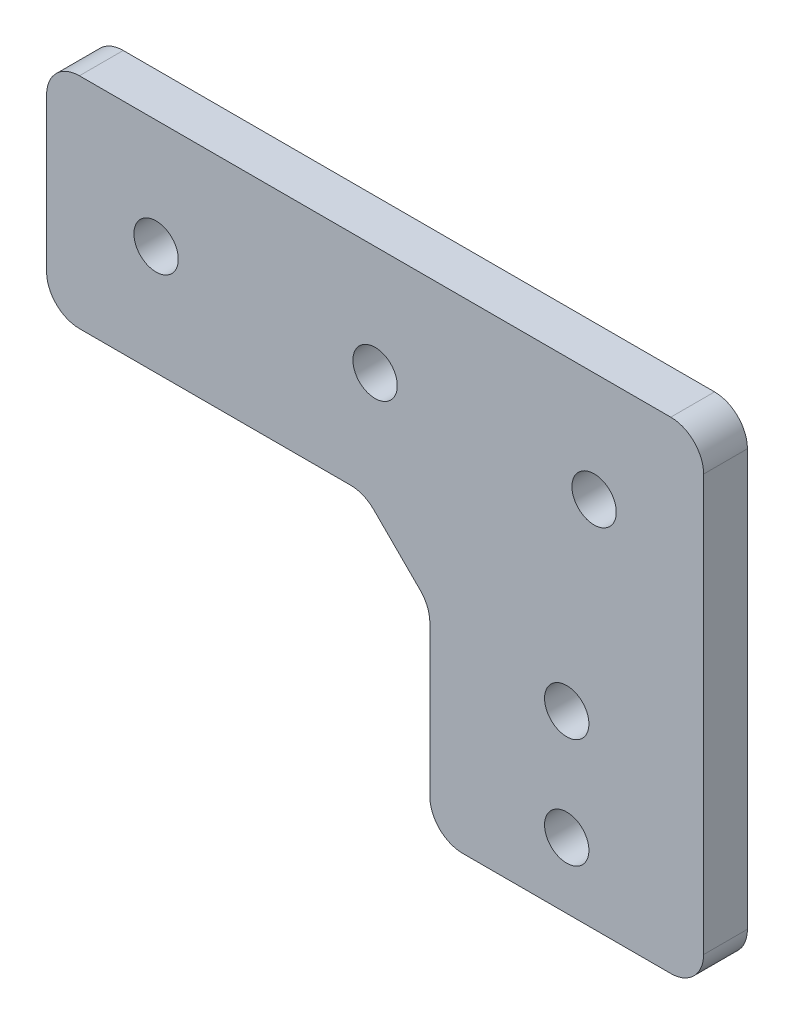
ISO-10303-21;
HEADER;
FILE_DESCRIPTION(('STEP AP214'),'2;1');
FILE_NAME('part.step','',(''),(''),'','','');
FILE_SCHEMA(('AUTOMOTIVE_DESIGN { 1 0 10303 214 1 1 1 1 }'));
ENDSEC;
DATA;
#1=APPLICATION_CONTEXT('core data for automotive mechanical design processes');
#2=APPLICATION_PROTOCOL_DEFINITION('international standard','automotive_design',2000,#1);
#3=PRODUCT_CONTEXT('',#1,'mechanical');
#4=PRODUCT('Part','Part','',(#3));
#5=PRODUCT_RELATED_PRODUCT_CATEGORY('part','',(#4));
#6=PRODUCT_DEFINITION_FORMATION('','',#4);
#7=PRODUCT_DEFINITION_CONTEXT('part definition',#1,'design');
#8=PRODUCT_DEFINITION('design','',#6,#7);
#9=PRODUCT_DEFINITION_SHAPE('','',#8);
#10=(LENGTH_UNIT() NAMED_UNIT(*) SI_UNIT(.MILLI.,.METRE.));
#11=(NAMED_UNIT(*) PLANE_ANGLE_UNIT() SI_UNIT($,.RADIAN.));
#12=(NAMED_UNIT(*) SI_UNIT($,.STERADIAN.) SOLID_ANGLE_UNIT());
#13=UNCERTAINTY_MEASURE_WITH_UNIT(LENGTH_MEASURE(1.E-05),#10,'distance_accuracy_value','');
#14=(GEOMETRIC_REPRESENTATION_CONTEXT(3) GLOBAL_UNCERTAINTY_ASSIGNED_CONTEXT((#13)) GLOBAL_UNIT_ASSIGNED_CONTEXT((#10,
#11,#12)) REPRESENTATION_CONTEXT('',''));
#15=CARTESIAN_POINT('',(0.,0.,0.));
#16=DIRECTION('',(0.,0.,1.));
#17=DIRECTION('',(1.,0.,0.));
#18=AXIS2_PLACEMENT_3D('',#15,#16,#17);
#19=CARTESIAN_POINT('',(-35.,20.,4.));
#20=DIRECTION('',(1.,0.,0.));
#21=DIRECTION('',(0.,1.,0.));
#22=AXIS2_PLACEMENT_3D('',#19,#20,#21);
#23=PLANE('',#22);
#24=DIRECTION('',(0.,-1.,0.));
#25=VECTOR('',#24,1.);
#26=CARTESIAN_POINT('',(-35.,20.,0.));
#27=LINE('',#26,#25);
#28=CARTESIAN_POINT('',(-35.,17.,0.));
#29=VERTEX_POINT('',#28);
#30=CARTESIAN_POINT('',(-35.,3.00000000000001,0.));
#31=VERTEX_POINT('',#30);
#32=EDGE_CURVE('E242',#29,#31,#27,.T.);
#33=ORIENTED_EDGE('',*,*,#32,.T.);
#34=DIRECTION('',(0.,0.,-1.));
#35=VECTOR('',#34,1.);
#36=CARTESIAN_POINT('',(-35.,3.00000000000001,4.));
#37=LINE('',#36,#35);
#38=CARTESIAN_POINT('',(-35.,3.00000000000001,4.));
#39=VERTEX_POINT('',#38);
#40=EDGE_CURVE('E205',#31,#39,#37,.F.);
#41=ORIENTED_EDGE('',*,*,#40,.T.);
#42=DIRECTION('',(0.,-1.,0.));
#43=VECTOR('',#42,1.);
#44=CARTESIAN_POINT('',(-35.,20.,4.));
#45=LINE('',#44,#43);
#46=CARTESIAN_POINT('',(-35.,17.,4.));
#47=VERTEX_POINT('',#46);
#48=EDGE_CURVE('E236',#47,#39,#45,.T.);
#49=ORIENTED_EDGE('',*,*,#48,.F.);
#50=DIRECTION('',(0.,0.,-1.));
#51=VECTOR('',#50,1.);
#52=CARTESIAN_POINT('',(-35.,17.,4.));
#53=LINE('',#52,#51);
#54=EDGE_CURVE('E202',#47,#29,#53,.T.);
#55=ORIENTED_EDGE('',*,*,#54,.T.);
#56=EDGE_LOOP('',(#33,#41,#49,#55));
#57=FACE_BOUND('',#56,.T.);
#58=ADVANCED_FACE('F35',(#57),#23,.F.);
#59=CARTESIAN_POINT('',(-35.,0.,4.));
#60=DIRECTION('',(0.,1.,0.));
#61=DIRECTION('',(0.,0.,1.));
#62=AXIS2_PLACEMENT_3D('',#59,#60,#61);
#63=PLANE('',#62);
#64=DIRECTION('',(1.,0.,0.));
#65=VECTOR('',#64,1.);
#66=CARTESIAN_POINT('',(-35.,0.,0.));
#67=LINE('',#66,#65);
#68=CARTESIAN_POINT('',(-32.,0.,0.));
#69=VERTEX_POINT('',#68);
#70=CARTESIAN_POINT('',(-7.24264068711929,0.,0.));
#71=VERTEX_POINT('',#70);
#72=EDGE_CURVE('E245',#69,#71,#67,.T.);
#73=ORIENTED_EDGE('',*,*,#72,.T.);
#74=DIRECTION('',(0.,0.,-1.));
#75=VECTOR('',#74,1.);
#76=CARTESIAN_POINT('',(-7.24264068711929,0.,4.));
#77=LINE('',#76,#75);
#78=CARTESIAN_POINT('',(-7.24264068711929,0.,4.));
#79=VERTEX_POINT('',#78);
#80=EDGE_CURVE('E200',#71,#79,#77,.F.);
#81=ORIENTED_EDGE('',*,*,#80,.T.);
#82=DIRECTION('',(1.,0.,0.));
#83=VECTOR('',#82,1.);
#84=CARTESIAN_POINT('',(-35.,0.,4.));
#85=LINE('',#84,#83);
#86=CARTESIAN_POINT('',(-32.,0.,4.));
#87=VERTEX_POINT('',#86);
#88=EDGE_CURVE('E233',#87,#79,#85,.T.);
#89=ORIENTED_EDGE('',*,*,#88,.F.);
#90=DIRECTION('',(0.,0.,-1.));
#91=VECTOR('',#90,1.);
#92=CARTESIAN_POINT('',(-32.,0.,4.));
#93=LINE('',#92,#91);
#94=EDGE_CURVE('E197',#87,#69,#93,.T.);
#95=ORIENTED_EDGE('',*,*,#94,.T.);
#96=EDGE_LOOP('',(#73,#81,#89,#95));
#97=FACE_BOUND('',#96,.T.);
#98=ADVANCED_FACE('F272',(#97),#63,.F.);
#99=CARTESIAN_POINT('',(0.,0.,4.));
#100=DIRECTION('',(1.,0.,0.));
#101=DIRECTION('',(0.,1.,0.));
#102=AXIS2_PLACEMENT_3D('',#99,#100,#101);
#103=PLANE('',#102);
#104=DIRECTION('',(0.,-1.,0.));
#105=VECTOR('',#104,1.);
#106=CARTESIAN_POINT('',(0.,0.,0.));
#107=LINE('',#106,#105);
#108=CARTESIAN_POINT('',(0.,-7.24264068711929,0.));
#109=VERTEX_POINT('',#108);
#110=CARTESIAN_POINT('',(0.,-21.,0.));
#111=VERTEX_POINT('',#110);
#112=EDGE_CURVE('E221',#109,#111,#107,.T.);
#113=ORIENTED_EDGE('',*,*,#112,.T.);
#114=DIRECTION('',(0.,0.,-1.));
#115=VECTOR('',#114,1.);
#116=CARTESIAN_POINT('',(0.,-21.,4.));
#117=LINE('',#116,#115);
#118=CARTESIAN_POINT('',(0.,-21.,4.));
#119=VERTEX_POINT('',#118);
#120=EDGE_CURVE('E50',#111,#119,#117,.F.);
#121=ORIENTED_EDGE('',*,*,#120,.T.);
#122=DIRECTION('',(0.,-1.,0.));
#123=VECTOR('',#122,1.);
#124=CARTESIAN_POINT('',(0.,0.,4.));
#125=LINE('',#124,#123);
#126=CARTESIAN_POINT('',(0.,-7.24264068711929,4.));
#127=VERTEX_POINT('',#126);
#128=EDGE_CURVE('E159',#127,#119,#125,.T.);
#129=ORIENTED_EDGE('',*,*,#128,.F.);
#130=DIRECTION('',(0.,0.,-1.));
#131=VECTOR('',#130,1.);
#132=CARTESIAN_POINT('',(0.,-7.24264068711929,4.));
#133=LINE('',#132,#131);
#134=EDGE_CURVE('E147',#127,#109,#133,.T.);
#135=ORIENTED_EDGE('',*,*,#134,.T.);
#136=EDGE_LOOP('',(#113,#121,#129,#135));
#137=FACE_BOUND('',#136,.T.);
#138=ADVANCED_FACE('F231',(#137),#103,.F.);
#139=CARTESIAN_POINT('',(25.,-30.,4.));
#140=DIRECTION('',(-1.,0.,0.));
#141=DIRECTION('',(0.,-1.,0.));
#142=AXIS2_PLACEMENT_3D('',#139,#140,#141);
#143=PLANE('',#142);
#144=DIRECTION('',(0.,1.,0.));
#145=VECTOR('',#144,1.);
#146=CARTESIAN_POINT('',(25.,-30.,4.));
#147=LINE('',#146,#145);
#148=CARTESIAN_POINT('',(25.,-21.,4.));
#149=VERTEX_POINT('',#148);
#150=CARTESIAN_POINT('',(25.,17.,4.));
#151=VERTEX_POINT('',#150);
#152=EDGE_CURVE('E140',#149,#151,#147,.T.);
#153=ORIENTED_EDGE('',*,*,#152,.F.);
#154=DIRECTION('',(0.,0.,-1.));
#155=VECTOR('',#154,1.);
#156=CARTESIAN_POINT('',(25.,-21.,4.));
#157=LINE('',#156,#155);
#158=CARTESIAN_POINT('',(25.,-21.,0.));
#159=VERTEX_POINT('',#158);
#160=EDGE_CURVE('E154',#149,#159,#157,.T.);
#161=ORIENTED_EDGE('',*,*,#160,.T.);
#162=DIRECTION('',(0.,1.,0.));
#163=VECTOR('',#162,1.);
#164=CARTESIAN_POINT('',(25.,-30.,0.));
#165=LINE('',#164,#163);
#166=CARTESIAN_POINT('',(25.,17.,0.));
#167=VERTEX_POINT('',#166);
#168=EDGE_CURVE('E249',#159,#167,#165,.T.);
#169=ORIENTED_EDGE('',*,*,#168,.T.);
#170=DIRECTION('',(0.,0.,-1.));
#171=VECTOR('',#170,1.);
#172=CARTESIAN_POINT('',(25.,17.,4.));
#173=LINE('',#172,#171);
#174=EDGE_CURVE('E157',#167,#151,#173,.F.);
#175=ORIENTED_EDGE('',*,*,#174,.T.);
#176=EDGE_LOOP('',(#153,#161,#169,#175));
#177=FACE_BOUND('',#176,.T.);
#178=ADVANCED_FACE('F152',(#177),#143,.F.);
#179=CARTESIAN_POINT('',(25.,20.,4.));
#180=DIRECTION('',(0.,-1.,0.));
#181=DIRECTION('',(1.,0.,0.));
#182=AXIS2_PLACEMENT_3D('',#179,#180,#181);
#183=PLANE('',#182);
#184=DIRECTION('',(-1.,0.,0.));
#185=VECTOR('',#184,1.);
#186=CARTESIAN_POINT('',(25.,20.,0.));
#187=LINE('',#186,#185);
#188=CARTESIAN_POINT('',(22.,20.,0.));
#189=VERTEX_POINT('',#188);
#190=CARTESIAN_POINT('',(-32.,20.,0.));
#191=VERTEX_POINT('',#190);
#192=EDGE_CURVE('E251',#189,#191,#187,.T.);
#193=ORIENTED_EDGE('',*,*,#192,.T.);
#194=DIRECTION('',(0.,0.,-1.));
#195=VECTOR('',#194,1.);
#196=CARTESIAN_POINT('',(-32.,20.,4.));
#197=LINE('',#196,#195);
#198=CARTESIAN_POINT('',(-32.,20.,4.));
#199=VERTEX_POINT('',#198);
#200=EDGE_CURVE('E210',#191,#199,#197,.F.);
#201=ORIENTED_EDGE('',*,*,#200,.T.);
#202=DIRECTION('',(-1.,0.,0.));
#203=VECTOR('',#202,1.);
#204=CARTESIAN_POINT('',(25.,20.,4.));
#205=LINE('',#204,#203);
#206=CARTESIAN_POINT('',(22.,20.,4.));
#207=VERTEX_POINT('',#206);
#208=EDGE_CURVE('E158',#207,#199,#205,.T.);
#209=ORIENTED_EDGE('',*,*,#208,.F.);
#210=DIRECTION('',(0.,0.,-1.));
#211=VECTOR('',#210,1.);
#212=CARTESIAN_POINT('',(22.,20.,4.));
#213=LINE('',#212,#211);
#214=EDGE_CURVE('E207',#207,#189,#213,.T.);
#215=ORIENTED_EDGE('',*,*,#214,.T.);
#216=EDGE_LOOP('',(#193,#201,#209,#215));
#217=FACE_BOUND('',#216,.T.);
#218=ADVANCED_FACE('F285',(#217),#183,.F.);
#219=CARTESIAN_POINT('',(0.,0.,4.));
#220=DIRECTION('',(0.,0.,1.));
#221=DIRECTION('',(1.,0.,0.));
#222=AXIS2_PLACEMENT_3D('',#219,#220,#221);
#223=PLANE('',#222);
#224=DIRECTION('',(1.,0.,0.));
#225=VECTOR('',#224,1.);
#226=CARTESIAN_POINT('',(25.,-24.,4.));
#227=LINE('',#226,#225);
#228=CARTESIAN_POINT('',(3.00000000000001,-24.,4.));
#229=VERTEX_POINT('',#228);
#230=CARTESIAN_POINT('',(22.,-24.,4.));
#231=VERTEX_POINT('',#230);
#232=EDGE_CURVE('E143',#229,#231,#227,.T.);
#233=ORIENTED_EDGE('',*,*,#232,.T.);
#234=CARTESIAN_POINT('',(22.,-21.,4.));
#235=DIRECTION('',(0.,0.,1.));
#236=DIRECTION('',(1.,0.,0.));
#237=AXIS2_PLACEMENT_3D('',#234,#235,#236);
#238=CIRCLE('',#237,3.);
#239=EDGE_CURVE('E136',#231,#149,#238,.T.);
#240=ORIENTED_EDGE('',*,*,#239,.T.);
#241=ORIENTED_EDGE('',*,*,#152,.T.);
#242=CARTESIAN_POINT('',(22.,17.,4.));
#243=DIRECTION('',(0.,0.,1.));
#244=DIRECTION('',(1.,0.,0.));
#245=AXIS2_PLACEMENT_3D('',#242,#243,#244);
#246=CIRCLE('',#245,3.);
#247=EDGE_CURVE('E182',#151,#207,#246,.T.);
#248=ORIENTED_EDGE('',*,*,#247,.T.);
#249=ORIENTED_EDGE('',*,*,#208,.T.);
#250=CARTESIAN_POINT('',(-32.,17.,4.));
#251=DIRECTION('',(0.,0.,1.));
#252=DIRECTION('',(1.,0.,0.));
#253=AXIS2_PLACEMENT_3D('',#250,#251,#252);
#254=CIRCLE('',#253,3.);
#255=EDGE_CURVE('E184',#199,#47,#254,.T.);
#256=ORIENTED_EDGE('',*,*,#255,.T.);
#257=ORIENTED_EDGE('',*,*,#48,.T.);
#258=CARTESIAN_POINT('',(-32.,3.,4.));
#259=DIRECTION('',(0.,0.,1.));
#260=DIRECTION('',(1.,0.,0.));
#261=AXIS2_PLACEMENT_3D('',#258,#259,#260);
#262=CIRCLE('',#261,3.);
#263=EDGE_CURVE('E186',#39,#87,#262,.T.);
#264=ORIENTED_EDGE('',*,*,#263,.T.);
#265=ORIENTED_EDGE('',*,*,#88,.T.);
#266=CARTESIAN_POINT('',(-7.24264068711929,-3.,4.));
#267=DIRECTION('',(0.,0.,1.));
#268=DIRECTION('',(1.,0.,0.));
#269=AXIS2_PLACEMENT_3D('',#266,#267,#268);
#270=CIRCLE('',#269,3.);
#271=CARTESIAN_POINT('',(-5.12132034355964,-0.878679656440356,4.));
#272=VERTEX_POINT('',#271);
#273=EDGE_CURVE('E214',#79,#272,#270,.F.);
#274=ORIENTED_EDGE('',*,*,#273,.T.);
#275=DIRECTION('',(-0.707106781186547,0.707106781186548,0.));
#276=VECTOR('',#275,1.);
#277=CARTESIAN_POINT('',(0.,-6.,4.));
#278=LINE('',#277,#276);
#279=CARTESIAN_POINT('',(-0.878679656440354,-5.12132034355965,4.));
#280=VERTEX_POINT('',#279);
#281=EDGE_CURVE('E229',#280,#272,#278,.T.);
#282=ORIENTED_EDGE('',*,*,#281,.F.);
#283=CARTESIAN_POINT('',(-3.,-7.24264068711929,4.));
#284=DIRECTION('',(0.,0.,1.));
#285=DIRECTION('',(1.,0.,0.));
#286=AXIS2_PLACEMENT_3D('',#283,#284,#285);
#287=CIRCLE('',#286,3.);
#288=EDGE_CURVE('E11',#280,#127,#287,.F.);
#289=ORIENTED_EDGE('',*,*,#288,.T.);
#290=ORIENTED_EDGE('',*,*,#128,.T.);
#291=CARTESIAN_POINT('',(3.00000000000001,-21.,4.));
#292=DIRECTION('',(0.,0.,1.));
#293=DIRECTION('',(1.,0.,0.));
#294=AXIS2_PLACEMENT_3D('',#291,#292,#293);
#295=CIRCLE('',#294,3.);
#296=EDGE_CURVE('E148',#119,#229,#295,.T.);
#297=ORIENTED_EDGE('',*,*,#296,.T.);
#298=EDGE_LOOP('',(#233,#240,#241,#248,#249,#256,#257,#264,#265,#274,#282,#289,#290,#297));
#299=FACE_BOUND('',#298,.T.);
#300=CARTESIAN_POINT('',(15.,10.,4.));
#301=DIRECTION('',(0.,0.,-1.));
#302=DIRECTION('',(-1.,0.,0.));
#303=AXIS2_PLACEMENT_3D('',#300,#301,#302);
#304=CIRCLE('',#303,2.025);
#305=CARTESIAN_POINT('',(12.975,10.,4.));
#306=VERTEX_POINT('',#305);
#307=EDGE_CURVE('E393',#306,#306,#304,.T.);
#308=ORIENTED_EDGE('',*,*,#307,.T.);
#309=EDGE_LOOP('',(#308));
#310=FACE_BOUND('',#309,.T.);
#311=CARTESIAN_POINT('',(-5.,10.,4.));
#312=DIRECTION('',(0.,0.,-1.));
#313=DIRECTION('',(-1.,0.,0.));
#314=AXIS2_PLACEMENT_3D('',#311,#312,#313);
#315=CIRCLE('',#314,2.025);
#316=CARTESIAN_POINT('',(-7.025,10.,4.));
#317=VERTEX_POINT('',#316);
#318=EDGE_CURVE('E410',#317,#317,#315,.T.);
#319=ORIENTED_EDGE('',*,*,#318,.T.);
#320=EDGE_LOOP('',(#319));
#321=FACE_BOUND('',#320,.T.);
#322=CARTESIAN_POINT('',(-25.,10.,4.));
#323=DIRECTION('',(0.,0.,-1.));
#324=DIRECTION('',(-1.,0.,0.));
#325=AXIS2_PLACEMENT_3D('',#322,#323,#324);
#326=CIRCLE('',#325,2.025);
#327=CARTESIAN_POINT('',(-27.025,10.,4.));
#328=VERTEX_POINT('',#327);
#329=EDGE_CURVE('E404',#328,#328,#326,.T.);
#330=ORIENTED_EDGE('',*,*,#329,.T.);
#331=EDGE_LOOP('',(#330));
#332=FACE_BOUND('',#331,.T.);
#333=CARTESIAN_POINT('',(12.5,-8.,4.));
#334=DIRECTION('',(0.,0.,-1.));
#335=DIRECTION('',(-1.,0.,0.));
#336=AXIS2_PLACEMENT_3D('',#333,#334,#335);
#337=CIRCLE('',#336,2.025);
#338=CARTESIAN_POINT('',(10.475,-8.,4.));
#339=VERTEX_POINT('',#338);
#340=EDGE_CURVE('E388',#339,#339,#337,.T.);
#341=ORIENTED_EDGE('',*,*,#340,.T.);
#342=EDGE_LOOP('',(#341));
#343=FACE_BOUND('',#342,.T.);
#344=CARTESIAN_POINT('',(12.5,-18.,4.));
#345=DIRECTION('',(0.,0.,-1.));
#346=DIRECTION('',(-1.,0.,0.));
#347=AXIS2_PLACEMENT_3D('',#344,#345,#346);
#348=CIRCLE('',#347,2.025);
#349=CARTESIAN_POINT('',(10.475,-18.,4.));
#350=VERTEX_POINT('',#349);
#351=EDGE_CURVE('E392',#350,#350,#348,.T.);
#352=ORIENTED_EDGE('',*,*,#351,.T.);
#353=EDGE_LOOP('',(#352));
#354=FACE_BOUND('',#353,.T.);
#355=ADVANCED_FACE('F138',(#299,#310,#321,#332,#343,#354),#223,.T.);
#356=CARTESIAN_POINT('',(0.,0.,0.));
#357=DIRECTION('',(0.,0.,1.));
#358=DIRECTION('',(1.,0.,0.));
#359=AXIS2_PLACEMENT_3D('',#356,#357,#358);
#360=PLANE('',#359);
#361=CARTESIAN_POINT('',(15.,10.,0.));
#362=DIRECTION('',(0.,0.,-1.));
#363=DIRECTION('',(-1.,0.,0.));
#364=AXIS2_PLACEMENT_3D('',#361,#362,#363);
#365=CIRCLE('',#364,2.025);
#366=CARTESIAN_POINT('',(12.975,10.,0.));
#367=VERTEX_POINT('',#366);
#368=EDGE_CURVE('E413',#367,#367,#365,.T.);
#369=ORIENTED_EDGE('',*,*,#368,.F.);
#370=EDGE_LOOP('',(#369));
#371=FACE_BOUND('',#370,.T.);
#372=CARTESIAN_POINT('',(-5.,10.,0.));
#373=DIRECTION('',(0.,0.,-1.));
#374=DIRECTION('',(-1.,0.,0.));
#375=AXIS2_PLACEMENT_3D('',#372,#373,#374);
#376=CIRCLE('',#375,2.025);
#377=CARTESIAN_POINT('',(-7.025,10.,0.));
#378=VERTEX_POINT('',#377);
#379=EDGE_CURVE('E407',#378,#378,#376,.T.);
#380=ORIENTED_EDGE('',*,*,#379,.F.);
#381=EDGE_LOOP('',(#380));
#382=FACE_BOUND('',#381,.T.);
#383=CARTESIAN_POINT('',(-25.,10.,0.));
#384=DIRECTION('',(0.,0.,-1.));
#385=DIRECTION('',(-1.,0.,0.));
#386=AXIS2_PLACEMENT_3D('',#383,#384,#385);
#387=CIRCLE('',#386,2.025);
#388=CARTESIAN_POINT('',(-27.025,10.,0.));
#389=VERTEX_POINT('',#388);
#390=EDGE_CURVE('E401',#389,#389,#387,.T.);
#391=ORIENTED_EDGE('',*,*,#390,.F.);
#392=EDGE_LOOP('',(#391));
#393=FACE_BOUND('',#392,.T.);
#394=CARTESIAN_POINT('',(12.5,-8.,0.));
#395=DIRECTION('',(0.,0.,-1.));
#396=DIRECTION('',(-1.,0.,0.));
#397=AXIS2_PLACEMENT_3D('',#394,#395,#396);
#398=CIRCLE('',#397,2.025);
#399=CARTESIAN_POINT('',(10.475,-8.,0.));
#400=VERTEX_POINT('',#399);
#401=EDGE_CURVE('E396',#400,#400,#398,.T.);
#402=ORIENTED_EDGE('',*,*,#401,.F.);
#403=EDGE_LOOP('',(#402));
#404=FACE_BOUND('',#403,.T.);
#405=CARTESIAN_POINT('',(12.5,-18.,0.));
#406=DIRECTION('',(0.,0.,-1.));
#407=DIRECTION('',(-1.,0.,0.));
#408=AXIS2_PLACEMENT_3D('',#405,#406,#407);
#409=CIRCLE('',#408,2.025);
#410=CARTESIAN_POINT('',(10.475,-18.,0.));
#411=VERTEX_POINT('',#410);
#412=EDGE_CURVE('E389',#411,#411,#409,.T.);
#413=ORIENTED_EDGE('',*,*,#412,.F.);
#414=EDGE_LOOP('',(#413));
#415=FACE_BOUND('',#414,.T.);
#416=ORIENTED_EDGE('',*,*,#168,.F.);
#417=CARTESIAN_POINT('',(22.,-21.,0.));
#418=DIRECTION('',(0.,0.,1.));
#419=DIRECTION('',(1.,0.,0.));
#420=AXIS2_PLACEMENT_3D('',#417,#418,#419);
#421=CIRCLE('',#420,3.);
#422=CARTESIAN_POINT('',(22.,-24.,0.));
#423=VERTEX_POINT('',#422);
#424=EDGE_CURVE('E162',#159,#423,#421,.F.);
#425=ORIENTED_EDGE('',*,*,#424,.T.);
#426=DIRECTION('',(-1.,0.,0.));
#427=VECTOR('',#426,1.);
#428=CARTESIAN_POINT('',(0.,-24.,0.));
#429=LINE('',#428,#427);
#430=CARTESIAN_POINT('',(3.00000000000001,-24.,0.));
#431=VERTEX_POINT('',#430);
#432=EDGE_CURVE('E167',#423,#431,#429,.T.);
#433=ORIENTED_EDGE('',*,*,#432,.T.);
#434=CARTESIAN_POINT('',(3.00000000000001,-21.,0.));
#435=DIRECTION('',(0.,0.,1.));
#436=DIRECTION('',(1.,0.,0.));
#437=AXIS2_PLACEMENT_3D('',#434,#435,#436);
#438=CIRCLE('',#437,3.);
#439=EDGE_CURVE('E174',#431,#111,#438,.F.);
#440=ORIENTED_EDGE('',*,*,#439,.T.);
#441=ORIENTED_EDGE('',*,*,#112,.F.);
#442=CARTESIAN_POINT('',(-3.,-7.24264068711929,0.));
#443=DIRECTION('',(0.,0.,1.));
#444=DIRECTION('',(1.,0.,0.));
#445=AXIS2_PLACEMENT_3D('',#442,#443,#444);
#446=CIRCLE('',#445,3.);
#447=CARTESIAN_POINT('',(-0.878679656440354,-5.12132034355965,0.));
#448=VERTEX_POINT('',#447);
#449=EDGE_CURVE('E43',#109,#448,#446,.T.);
#450=ORIENTED_EDGE('',*,*,#449,.T.);
#451=DIRECTION('',(-0.707106781186547,0.707106781186548,0.));
#452=VECTOR('',#451,1.);
#453=CARTESIAN_POINT('',(0.,-6.,0.));
#454=LINE('',#453,#452);
#455=CARTESIAN_POINT('',(-5.12132034355964,-0.878679656440356,0.));
#456=VERTEX_POINT('',#455);
#457=EDGE_CURVE('E220',#448,#456,#454,.T.);
#458=ORIENTED_EDGE('',*,*,#457,.T.);
#459=CARTESIAN_POINT('',(-7.24264068711929,-3.,0.));
#460=DIRECTION('',(0.,0.,1.));
#461=DIRECTION('',(1.,0.,0.));
#462=AXIS2_PLACEMENT_3D('',#459,#460,#461);
#463=CIRCLE('',#462,3.);
#464=EDGE_CURVE('E212',#456,#71,#463,.T.);
#465=ORIENTED_EDGE('',*,*,#464,.T.);
#466=ORIENTED_EDGE('',*,*,#72,.F.);
#467=CARTESIAN_POINT('',(-32.,3.,0.));
#468=DIRECTION('',(0.,0.,1.));
#469=DIRECTION('',(1.,0.,0.));
#470=AXIS2_PLACEMENT_3D('',#467,#468,#469);
#471=CIRCLE('',#470,3.);
#472=EDGE_CURVE('E172',#69,#31,#471,.F.);
#473=ORIENTED_EDGE('',*,*,#472,.T.);
#474=ORIENTED_EDGE('',*,*,#32,.F.);
#475=CARTESIAN_POINT('',(-32.,17.,0.));
#476=DIRECTION('',(0.,0.,1.));
#477=DIRECTION('',(1.,0.,0.));
#478=AXIS2_PLACEMENT_3D('',#475,#476,#477);
#479=CIRCLE('',#478,3.);
#480=EDGE_CURVE('E165',#29,#191,#479,.F.);
#481=ORIENTED_EDGE('',*,*,#480,.T.);
#482=ORIENTED_EDGE('',*,*,#192,.F.);
#483=CARTESIAN_POINT('',(22.,17.,0.));
#484=DIRECTION('',(0.,0.,1.));
#485=DIRECTION('',(1.,0.,0.));
#486=AXIS2_PLACEMENT_3D('',#483,#484,#485);
#487=CIRCLE('',#486,3.);
#488=EDGE_CURVE('E163',#189,#167,#487,.F.);
#489=ORIENTED_EDGE('',*,*,#488,.T.);
#490=EDGE_LOOP('',(#416,#425,#433,#440,#441,#450,#458,#465,#466,#473,#474,#481,#482,#489));
#491=FACE_BOUND('',#490,.T.);
#492=ADVANCED_FACE('F219',(#371,#382,#393,#404,#415,#491),#360,.F.);
#493=CARTESIAN_POINT('',(25.,-24.,4.));
#494=DIRECTION('',(0.,1.,0.));
#495=DIRECTION('',(-1.,0.,0.));
#496=AXIS2_PLACEMENT_3D('',#493,#494,#495);
#497=PLANE('',#496);
#498=ORIENTED_EDGE('',*,*,#432,.F.);
#499=DIRECTION('',(0.,0.,-1.));
#500=VECTOR('',#499,1.);
#501=CARTESIAN_POINT('',(22.,-24.,4.));
#502=LINE('',#501,#500);
#503=EDGE_CURVE('E180',#423,#231,#502,.F.);
#504=ORIENTED_EDGE('',*,*,#503,.T.);
#505=ORIENTED_EDGE('',*,*,#232,.F.);
#506=DIRECTION('',(0.,0.,-1.));
#507=VECTOR('',#506,1.);
#508=CARTESIAN_POINT('',(3.00000000000001,-24.,4.));
#509=LINE('',#508,#507);
#510=EDGE_CURVE('E177',#229,#431,#509,.T.);
#511=ORIENTED_EDGE('',*,*,#510,.T.);
#512=EDGE_LOOP('',(#498,#504,#505,#511));
#513=FACE_BOUND('',#512,.T.);
#514=ADVANCED_FACE('F256',(#513),#497,.F.);
#515=CARTESIAN_POINT('',(12.5,-18.,4.));
#516=DIRECTION('',(0.,0.,-1.));
#517=DIRECTION('',(-1.,0.,0.));
#518=AXIS2_PLACEMENT_3D('',#515,#516,#517);
#519=CYLINDRICAL_SURFACE('',#518,2.025);
#520=ORIENTED_EDGE('',*,*,#351,.F.);
#521=EDGE_LOOP('',(#520));
#522=FACE_BOUND('',#521,.T.);
#523=ORIENTED_EDGE('',*,*,#412,.T.);
#524=EDGE_LOOP('',(#523));
#525=FACE_BOUND('',#524,.T.);
#526=ADVANCED_FACE('F296',(#522,#525),#519,.F.);
#527=CARTESIAN_POINT('',(12.5,-8.,4.));
#528=DIRECTION('',(0.,0.,-1.));
#529=DIRECTION('',(-1.,0.,0.));
#530=AXIS2_PLACEMENT_3D('',#527,#528,#529);
#531=CYLINDRICAL_SURFACE('',#530,2.025);
#532=ORIENTED_EDGE('',*,*,#340,.F.);
#533=EDGE_LOOP('',(#532));
#534=FACE_BOUND('',#533,.T.);
#535=ORIENTED_EDGE('',*,*,#401,.T.);
#536=EDGE_LOOP('',(#535));
#537=FACE_BOUND('',#536,.T.);
#538=ADVANCED_FACE('F299',(#534,#537),#531,.F.);
#539=CARTESIAN_POINT('',(-25.,10.,4.));
#540=DIRECTION('',(0.,0.,-1.));
#541=DIRECTION('',(-1.,0.,0.));
#542=AXIS2_PLACEMENT_3D('',#539,#540,#541);
#543=CYLINDRICAL_SURFACE('',#542,2.025);
#544=ORIENTED_EDGE('',*,*,#329,.F.);
#545=EDGE_LOOP('',(#544));
#546=FACE_BOUND('',#545,.T.);
#547=ORIENTED_EDGE('',*,*,#390,.T.);
#548=EDGE_LOOP('',(#547));
#549=FACE_BOUND('',#548,.T.);
#550=ADVANCED_FACE('F303',(#546,#549),#543,.F.);
#551=CARTESIAN_POINT('',(-5.,10.,4.));
#552=DIRECTION('',(0.,0.,-1.));
#553=DIRECTION('',(-1.,0.,0.));
#554=AXIS2_PLACEMENT_3D('',#551,#552,#553);
#555=CYLINDRICAL_SURFACE('',#554,2.025);
#556=ORIENTED_EDGE('',*,*,#318,.F.);
#557=EDGE_LOOP('',(#556));
#558=FACE_BOUND('',#557,.T.);
#559=ORIENTED_EDGE('',*,*,#379,.T.);
#560=EDGE_LOOP('',(#559));
#561=FACE_BOUND('',#560,.T.);
#562=ADVANCED_FACE('F307',(#558,#561),#555,.F.);
#563=CARTESIAN_POINT('',(15.,10.,4.));
#564=DIRECTION('',(0.,0.,-1.));
#565=DIRECTION('',(-1.,0.,0.));
#566=AXIS2_PLACEMENT_3D('',#563,#564,#565);
#567=CYLINDRICAL_SURFACE('',#566,2.025);
#568=ORIENTED_EDGE('',*,*,#307,.F.);
#569=EDGE_LOOP('',(#568));
#570=FACE_BOUND('',#569,.T.);
#571=ORIENTED_EDGE('',*,*,#368,.T.);
#572=EDGE_LOOP('',(#571));
#573=FACE_BOUND('',#572,.T.);
#574=ADVANCED_FACE('F311',(#570,#573),#567,.F.);
#575=CARTESIAN_POINT('',(0.,-6.,12.4852813742386));
#576=DIRECTION('',(-0.707106781186548,-0.707106781186548,0.));
#577=DIRECTION('',(0.707106781186547,-0.707106781186548,0.));
#578=AXIS2_PLACEMENT_3D('',#575,#576,#577);
#579=PLANE('',#578);
#580=ORIENTED_EDGE('',*,*,#281,.T.);
#581=DIRECTION('',(0.,0.,-1.));
#582=VECTOR('',#581,1.);
#583=CARTESIAN_POINT('',(-5.12132034355964,-0.878679656440356,12.4852813742386));
#584=LINE('',#583,#582);
#585=EDGE_CURVE('E194',#272,#456,#584,.T.);
#586=ORIENTED_EDGE('',*,*,#585,.T.);
#587=ORIENTED_EDGE('',*,*,#457,.F.);
#588=DIRECTION('',(0.,0.,-1.));
#589=VECTOR('',#588,1.);
#590=CARTESIAN_POINT('',(-0.878679656440354,-5.12132034355965,12.4852813742386));
#591=LINE('',#590,#589);
#592=EDGE_CURVE('E192',#448,#280,#591,.F.);
#593=ORIENTED_EDGE('',*,*,#592,.T.);
#594=EDGE_LOOP('',(#580,#586,#587,#593));
#595=FACE_BOUND('',#594,.T.);
#596=ADVANCED_FACE('F227',(#595),#579,.T.);
#597=CARTESIAN_POINT('',(22.,-21.,4.));
#598=DIRECTION('',(0.,0.,-1.));
#599=DIRECTION('',(-1.,0.,0.));
#600=AXIS2_PLACEMENT_3D('',#597,#598,#599);
#601=CYLINDRICAL_SURFACE('',#600,3.);
#602=ORIENTED_EDGE('',*,*,#239,.F.);
#603=ORIENTED_EDGE('',*,*,#503,.F.);
#604=ORIENTED_EDGE('',*,*,#424,.F.);
#605=ORIENTED_EDGE('',*,*,#160,.F.);
#606=EDGE_LOOP('',(#602,#603,#604,#605));
#607=FACE_BOUND('',#606,.T.);
#608=ADVANCED_FACE('F161',(#607),#601,.T.);
#609=CARTESIAN_POINT('',(3.00000000000001,-21.,4.));
#610=DIRECTION('',(0.,0.,-1.));
#611=DIRECTION('',(-1.,0.,0.));
#612=AXIS2_PLACEMENT_3D('',#609,#610,#611);
#613=CYLINDRICAL_SURFACE('',#612,3.);
#614=ORIENTED_EDGE('',*,*,#296,.F.);
#615=ORIENTED_EDGE('',*,*,#120,.F.);
#616=ORIENTED_EDGE('',*,*,#439,.F.);
#617=ORIENTED_EDGE('',*,*,#510,.F.);
#618=EDGE_LOOP('',(#614,#615,#616,#617));
#619=FACE_BOUND('',#618,.T.);
#620=ADVANCED_FACE('F259',(#619),#613,.T.);
#621=CARTESIAN_POINT('',(-7.24264068711929,-3.,12.4852813742386));
#622=DIRECTION('',(0.,0.,-1.));
#623=DIRECTION('',(-1.,0.,0.));
#624=AXIS2_PLACEMENT_3D('',#621,#622,#623);
#625=CYLINDRICAL_SURFACE('',#624,3.);
#626=ORIENTED_EDGE('',*,*,#273,.F.);
#627=ORIENTED_EDGE('',*,*,#80,.F.);
#628=ORIENTED_EDGE('',*,*,#464,.F.);
#629=ORIENTED_EDGE('',*,*,#585,.F.);
#630=EDGE_LOOP('',(#626,#627,#628,#629));
#631=FACE_BOUND('',#630,.T.);
#632=ADVANCED_FACE('F261',(#631),#625,.F.);
#633=CARTESIAN_POINT('',(-32.,3.,4.));
#634=DIRECTION('',(0.,0.,-1.));
#635=DIRECTION('',(-1.,0.,0.));
#636=AXIS2_PLACEMENT_3D('',#633,#634,#635);
#637=CYLINDRICAL_SURFACE('',#636,3.);
#638=ORIENTED_EDGE('',*,*,#263,.F.);
#639=ORIENTED_EDGE('',*,*,#40,.F.);
#640=ORIENTED_EDGE('',*,*,#472,.F.);
#641=ORIENTED_EDGE('',*,*,#94,.F.);
#642=EDGE_LOOP('',(#638,#639,#640,#641));
#643=FACE_BOUND('',#642,.T.);
#644=ADVANCED_FACE('F267',(#643),#637,.T.);
#645=CARTESIAN_POINT('',(-32.,17.,4.));
#646=DIRECTION('',(0.,0.,-1.));
#647=DIRECTION('',(-1.,0.,0.));
#648=AXIS2_PLACEMENT_3D('',#645,#646,#647);
#649=CYLINDRICAL_SURFACE('',#648,3.);
#650=ORIENTED_EDGE('',*,*,#255,.F.);
#651=ORIENTED_EDGE('',*,*,#200,.F.);
#652=ORIENTED_EDGE('',*,*,#480,.F.);
#653=ORIENTED_EDGE('',*,*,#54,.F.);
#654=EDGE_LOOP('',(#650,#651,#652,#653));
#655=FACE_BOUND('',#654,.T.);
#656=ADVANCED_FACE('F345',(#655),#649,.T.);
#657=CARTESIAN_POINT('',(22.,17.,4.));
#658=DIRECTION('',(0.,0.,-1.));
#659=DIRECTION('',(-1.,0.,0.));
#660=AXIS2_PLACEMENT_3D('',#657,#658,#659);
#661=CYLINDRICAL_SURFACE('',#660,3.);
#662=ORIENTED_EDGE('',*,*,#247,.F.);
#663=ORIENTED_EDGE('',*,*,#174,.F.);
#664=ORIENTED_EDGE('',*,*,#488,.F.);
#665=ORIENTED_EDGE('',*,*,#214,.F.);
#666=EDGE_LOOP('',(#662,#663,#664,#665));
#667=FACE_BOUND('',#666,.T.);
#668=ADVANCED_FACE('F355',(#667),#661,.T.);
#669=CARTESIAN_POINT('',(-3.,-7.24264068711929,4.));
#670=DIRECTION('',(0.,0.,-1.));
#671=DIRECTION('',(-1.,0.,0.));
#672=AXIS2_PLACEMENT_3D('',#669,#670,#671);
#673=CYLINDRICAL_SURFACE('',#672,3.);
#674=ORIENTED_EDGE('',*,*,#288,.F.);
#675=ORIENTED_EDGE('',*,*,#592,.F.);
#676=ORIENTED_EDGE('',*,*,#449,.F.);
#677=ORIENTED_EDGE('',*,*,#134,.F.);
#678=EDGE_LOOP('',(#674,#675,#676,#677));
#679=FACE_BOUND('',#678,.T.);
#680=ADVANCED_FACE('F37',(#679),#673,.F.);
#681=CLOSED_SHELL('',(#58,#98,#138,#178,#218,#355,#492,#514,#526,#538,#550,#562,#574,#596,#608,
#620,#632,#644,#656,#668,#680));
#682=MANIFOLD_SOLID_BREP('B2',#681);
#683=ADVANCED_BREP_SHAPE_REPRESENTATION('',(#18,#682),#14);
#684=SHAPE_DEFINITION_REPRESENTATION(#9,#683);
ENDSEC;
END-ISO-10303-21;
